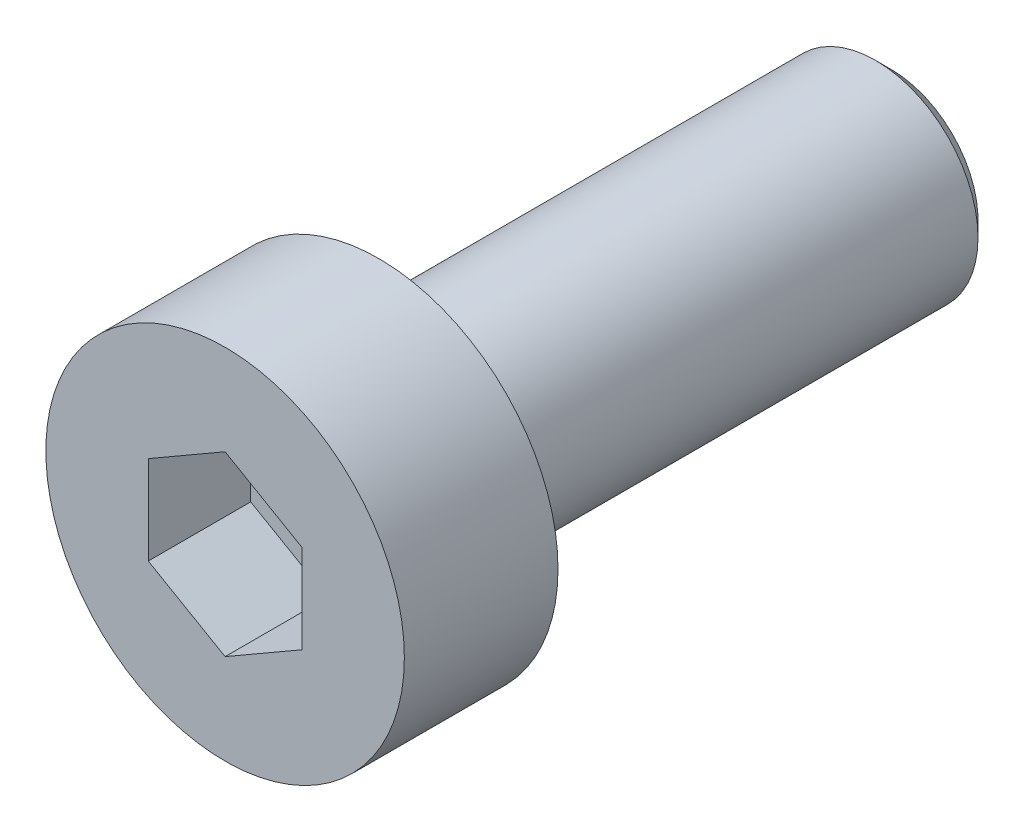
ISO-10303-21;
HEADER;
FILE_DESCRIPTION(('STEP AP214'),'2;1');
FILE_NAME('part.step','',(''),(''),'','','');
FILE_SCHEMA(('AUTOMOTIVE_DESIGN { 1 0 10303 214 1 1 1 1 }'));
ENDSEC;
DATA;
#1=APPLICATION_CONTEXT('core data for automotive mechanical design processes');
#2=APPLICATION_PROTOCOL_DEFINITION('international standard','automotive_design',2000,#1);
#3=PRODUCT_CONTEXT('',#1,'mechanical');
#4=PRODUCT('Part','Part','',(#3));
#5=PRODUCT_RELATED_PRODUCT_CATEGORY('part','',(#4));
#6=PRODUCT_DEFINITION_FORMATION('','',#4);
#7=PRODUCT_DEFINITION_CONTEXT('part definition',#1,'design');
#8=PRODUCT_DEFINITION('design','',#6,#7);
#9=PRODUCT_DEFINITION_SHAPE('','',#8);
#10=(LENGTH_UNIT() NAMED_UNIT(*) SI_UNIT(.MILLI.,.METRE.));
#11=(NAMED_UNIT(*) PLANE_ANGLE_UNIT() SI_UNIT($,.RADIAN.));
#12=(NAMED_UNIT(*) SI_UNIT($,.STERADIAN.) SOLID_ANGLE_UNIT());
#13=UNCERTAINTY_MEASURE_WITH_UNIT(LENGTH_MEASURE(1.E-05),#10,'distance_accuracy_value','');
#14=(GEOMETRIC_REPRESENTATION_CONTEXT(3) GLOBAL_UNCERTAINTY_ASSIGNED_CONTEXT((#13)) GLOBAL_UNIT_ASSIGNED_CONTEXT((#10,
#11,#12)) REPRESENTATION_CONTEXT('',''));
#15=CARTESIAN_POINT('',(0.,0.,0.));
#16=DIRECTION('',(0.,0.,1.));
#17=DIRECTION('',(1.,0.,0.));
#18=AXIS2_PLACEMENT_3D('',#15,#16,#17);
#19=CARTESIAN_POINT('',(0.,0.,0.));
#20=DIRECTION('',(0.,0.,1.));
#21=DIRECTION('',(1.,0.,0.));
#22=AXIS2_PLACEMENT_3D('',#19,#20,#21);
#23=PLANE('',#22);
#24=CARTESIAN_POINT('',(0.,0.,0.));
#25=DIRECTION('',(0.,0.,1.));
#26=DIRECTION('',(1.,0.,0.));
#27=AXIS2_PLACEMENT_3D('',#24,#25,#26);
#28=CIRCLE('',#27,3.5);
#29=CARTESIAN_POINT('',(3.5,0.,0.));
#30=VERTEX_POINT('',#29);
#31=EDGE_CURVE('E135',#30,#30,#28,.T.);
#32=ORIENTED_EDGE('',*,*,#31,.F.);
#33=EDGE_LOOP('',(#32));
#34=FACE_BOUND('',#33,.T.);
#35=CARTESIAN_POINT('',(0.,0.,0.));
#36=DIRECTION('',(0.,0.,1.));
#37=DIRECTION('',(1.,0.,0.));
#38=AXIS2_PLACEMENT_3D('',#35,#36,#37);
#39=CIRCLE('',#38,2.);
#40=CARTESIAN_POINT('',(2.,0.,0.));
#41=VERTEX_POINT('',#40);
#42=EDGE_CURVE('E144',#41,#41,#39,.F.);
#43=ORIENTED_EDGE('',*,*,#42,.F.);
#44=EDGE_LOOP('',(#43));
#45=FACE_BOUND('',#44,.T.);
#46=ADVANCED_FACE('F33',(#34,#45),#23,.F.);
#47=CARTESIAN_POINT('',(0.,0.,3.));
#48=DIRECTION('',(0.,0.,-1.));
#49=DIRECTION('',(-1.,0.,0.));
#50=AXIS2_PLACEMENT_3D('',#47,#48,#49);
#51=CYLINDRICAL_SURFACE('',#50,3.5);
#52=CARTESIAN_POINT('',(0.,0.,3.));
#53=DIRECTION('',(0.,0.,1.));
#54=DIRECTION('',(1.,0.,0.));
#55=AXIS2_PLACEMENT_3D('',#52,#53,#54);
#56=CIRCLE('',#55,3.5);
#57=CARTESIAN_POINT('',(3.5,0.,3.));
#58=VERTEX_POINT('',#57);
#59=EDGE_CURVE('E141',#58,#58,#56,.T.);
#60=ORIENTED_EDGE('',*,*,#59,.F.);
#61=EDGE_LOOP('',(#60));
#62=FACE_BOUND('',#61,.T.);
#63=ORIENTED_EDGE('',*,*,#31,.T.);
#64=EDGE_LOOP('',(#63));
#65=FACE_BOUND('',#64,.T.);
#66=ADVANCED_FACE('F166',(#62,#65),#51,.T.);
#67=CARTESIAN_POINT('',(0.,0.,3.));
#68=DIRECTION('',(0.,0.,1.));
#69=DIRECTION('',(1.,0.,0.));
#70=AXIS2_PLACEMENT_3D('',#67,#68,#69);
#71=PLANE('',#70);
#72=DIRECTION('',(-0.866025403784439,0.5,0.));
#73=VECTOR('',#72,1.);
#74=CARTESIAN_POINT('',(1.5,0.866025403784439,3.));
#75=LINE('',#74,#73);
#76=CARTESIAN_POINT('',(1.5,0.866025403784439,3.));
#77=VERTEX_POINT('',#76);
#78=CARTESIAN_POINT('',(0.,1.73205080756888,3.));
#79=VERTEX_POINT('',#78);
#80=EDGE_CURVE('E48',#77,#79,#75,.T.);
#81=ORIENTED_EDGE('',*,*,#80,.F.);
#82=DIRECTION('',(0.,1.,0.));
#83=VECTOR('',#82,1.);
#84=CARTESIAN_POINT('',(1.5,-0.866025403784439,3.));
#85=LINE('',#84,#83);
#86=CARTESIAN_POINT('',(1.5,-0.866025403784439,3.));
#87=VERTEX_POINT('',#86);
#88=EDGE_CURVE('E131',#87,#77,#85,.T.);
#89=ORIENTED_EDGE('',*,*,#88,.F.);
#90=DIRECTION('',(0.866025403784439,0.5,0.));
#91=VECTOR('',#90,1.);
#92=CARTESIAN_POINT('',(0.,-1.73205080756888,3.));
#93=LINE('',#92,#91);
#94=CARTESIAN_POINT('',(0.,-1.73205080756888,3.));
#95=VERTEX_POINT('',#94);
#96=EDGE_CURVE('E129',#95,#87,#93,.T.);
#97=ORIENTED_EDGE('',*,*,#96,.F.);
#98=DIRECTION('',(0.866025403784439,-0.5,0.));
#99=VECTOR('',#98,1.);
#100=CARTESIAN_POINT('',(-1.5,-0.866025403784439,3.));
#101=LINE('',#100,#99);
#102=CARTESIAN_POINT('',(-1.5,-0.866025403784439,3.));
#103=VERTEX_POINT('',#102);
#104=EDGE_CURVE('E96',#103,#95,#101,.T.);
#105=ORIENTED_EDGE('',*,*,#104,.F.);
#106=DIRECTION('',(0.,-1.,0.));
#107=VECTOR('',#106,1.);
#108=CARTESIAN_POINT('',(-1.5,0.866025403784439,3.));
#109=LINE('',#108,#107);
#110=CARTESIAN_POINT('',(-1.5,0.866025403784439,3.));
#111=VERTEX_POINT('',#110);
#112=EDGE_CURVE('E125',#111,#103,#109,.T.);
#113=ORIENTED_EDGE('',*,*,#112,.F.);
#114=DIRECTION('',(-0.866025403784439,-0.5,0.));
#115=VECTOR('',#114,1.);
#116=CARTESIAN_POINT('',(0.,1.73205080756888,3.));
#117=LINE('',#116,#115);
#118=EDGE_CURVE('E122',#79,#111,#117,.T.);
#119=ORIENTED_EDGE('',*,*,#118,.F.);
#120=EDGE_LOOP('',(#81,#89,#97,#105,#113,#119));
#121=FACE_BOUND('',#120,.T.);
#122=ORIENTED_EDGE('',*,*,#59,.T.);
#123=EDGE_LOOP('',(#122));
#124=FACE_BOUND('',#123,.T.);
#125=ADVANCED_FACE('F172',(#121,#124),#71,.T.);
#126=CARTESIAN_POINT('',(0.,0.,-10.));
#127=DIRECTION('',(0.,0.,1.));
#128=DIRECTION('',(1.,0.,0.));
#129=AXIS2_PLACEMENT_3D('',#126,#127,#128);
#130=CYLINDRICAL_SURFACE('',#129,2.);
#131=CARTESIAN_POINT('',(0.,0.,-9.7));
#132=DIRECTION('',(0.,0.,-1.));
#133=DIRECTION('',(-1.,0.,0.));
#134=AXIS2_PLACEMENT_3D('',#131,#132,#133);
#135=CIRCLE('',#134,2.);
#136=CARTESIAN_POINT('',(-2.,0.,-9.7));
#137=VERTEX_POINT('',#136);
#138=EDGE_CURVE('E11',#137,#137,#135,.F.);
#139=ORIENTED_EDGE('',*,*,#138,.T.);
#140=EDGE_LOOP('',(#139));
#141=FACE_BOUND('',#140,.T.);
#142=ORIENTED_EDGE('',*,*,#42,.T.);
#143=EDGE_LOOP('',(#142));
#144=FACE_BOUND('',#143,.T.);
#145=ADVANCED_FACE('F162',(#141,#144),#130,.T.);
#146=CARTESIAN_POINT('',(0.,0.,-10.));
#147=DIRECTION('',(0.,0.,-1.));
#148=DIRECTION('',(-1.,0.,0.));
#149=AXIS2_PLACEMENT_3D('',#146,#147,#148);
#150=PLANE('',#149);
#151=CARTESIAN_POINT('',(0.,0.,-10.));
#152=DIRECTION('',(0.,0.,-1.));
#153=DIRECTION('',(-1.,0.,0.));
#154=AXIS2_PLACEMENT_3D('',#151,#152,#153);
#155=CIRCLE('',#154,1.7);
#156=CARTESIAN_POINT('',(-1.7,0.,-10.));
#157=VERTEX_POINT('',#156);
#158=EDGE_CURVE('E41',#157,#157,#155,.T.);
#159=ORIENTED_EDGE('',*,*,#158,.T.);
#160=EDGE_LOOP('',(#159));
#161=FACE_BOUND('',#160,.T.);
#162=ADVANCED_FACE('F151',(#161),#150,.T.);
#163=CARTESIAN_POINT('',(0.,0.,-10.));
#164=DIRECTION('',(0.,0.,1.));
#165=DIRECTION('',(1.,0.,0.));
#166=AXIS2_PLACEMENT_3D('',#163,#164,#165);
#167=CONICAL_SURFACE('',#166,1.7,0.785398163397446);
#168=ORIENTED_EDGE('',*,*,#138,.F.);
#169=EDGE_LOOP('',(#168));
#170=FACE_BOUND('',#169,.T.);
#171=ORIENTED_EDGE('',*,*,#158,.F.);
#172=EDGE_LOOP('',(#171));
#173=FACE_BOUND('',#172,.T.);
#174=ADVANCED_FACE('F35',(#170,#173),#167,.T.);
#175=CARTESIAN_POINT('',(1.5,0.866025403784439,1.));
#176=DIRECTION('',(0.5,0.866025403784439,0.));
#177=DIRECTION('',(-0.866025403784439,0.5,0.));
#178=AXIS2_PLACEMENT_3D('',#175,#176,#177);
#179=PLANE('',#178);
#180=ORIENTED_EDGE('',*,*,#80,.T.);
#181=DIRECTION('',(0.,0.,1.));
#182=VECTOR('',#181,1.);
#183=CARTESIAN_POINT('',(0.,1.73205080756888,1.));
#184=LINE('',#183,#182);
#185=CARTESIAN_POINT('',(0.,1.73205080756888,1.));
#186=VERTEX_POINT('',#185);
#187=EDGE_CURVE('E78',#186,#79,#184,.T.);
#188=ORIENTED_EDGE('',*,*,#187,.F.);
#189=DIRECTION('',(-0.866025403784439,0.5,0.));
#190=VECTOR('',#189,1.);
#191=CARTESIAN_POINT('',(1.5,0.866025403784439,1.));
#192=LINE('',#191,#190);
#193=CARTESIAN_POINT('',(1.5,0.866025403784439,1.));
#194=VERTEX_POINT('',#193);
#195=EDGE_CURVE('E133',#194,#186,#192,.T.);
#196=ORIENTED_EDGE('',*,*,#195,.F.);
#197=DIRECTION('',(0.,0.,1.));
#198=VECTOR('',#197,1.);
#199=CARTESIAN_POINT('',(1.5,0.866025403784439,1.));
#200=LINE('',#199,#198);
#201=EDGE_CURVE('E56',#194,#77,#200,.T.);
#202=ORIENTED_EDGE('',*,*,#201,.T.);
#203=EDGE_LOOP('',(#180,#188,#196,#202));
#204=FACE_BOUND('',#203,.T.);
#205=ADVANCED_FACE('F154',(#204),#179,.F.);
#206=CARTESIAN_POINT('',(1.5,-0.866025403784439,1.));
#207=DIRECTION('',(1.,0.,0.));
#208=DIRECTION('',(0.,1.,0.));
#209=AXIS2_PLACEMENT_3D('',#206,#207,#208);
#210=PLANE('',#209);
#211=ORIENTED_EDGE('',*,*,#88,.T.);
#212=ORIENTED_EDGE('',*,*,#201,.F.);
#213=DIRECTION('',(0.,1.,0.));
#214=VECTOR('',#213,1.);
#215=CARTESIAN_POINT('',(1.5,-0.866025403784439,1.));
#216=LINE('',#215,#214);
#217=CARTESIAN_POINT('',(1.5,-0.866025403784439,1.));
#218=VERTEX_POINT('',#217);
#219=EDGE_CURVE('E108',#218,#194,#216,.T.);
#220=ORIENTED_EDGE('',*,*,#219,.F.);
#221=DIRECTION('',(0.,0.,1.));
#222=VECTOR('',#221,1.);
#223=CARTESIAN_POINT('',(1.5,-0.866025403784439,1.));
#224=LINE('',#223,#222);
#225=EDGE_CURVE('E100',#218,#87,#224,.T.);
#226=ORIENTED_EDGE('',*,*,#225,.T.);
#227=EDGE_LOOP('',(#211,#212,#220,#226));
#228=FACE_BOUND('',#227,.T.);
#229=ADVANCED_FACE('F160',(#228),#210,.F.);
#230=CARTESIAN_POINT('',(0.,-1.73205080756888,1.));
#231=DIRECTION('',(0.5,-0.866025403784439,0.));
#232=DIRECTION('',(0.866025403784439,0.5,0.));
#233=AXIS2_PLACEMENT_3D('',#230,#231,#232);
#234=PLANE('',#233);
#235=ORIENTED_EDGE('',*,*,#96,.T.);
#236=ORIENTED_EDGE('',*,*,#225,.F.);
#237=DIRECTION('',(0.866025403784439,0.5,0.));
#238=VECTOR('',#237,1.);
#239=CARTESIAN_POINT('',(0.,-1.73205080756888,1.));
#240=LINE('',#239,#238);
#241=CARTESIAN_POINT('',(0.,-1.73205080756888,1.));
#242=VERTEX_POINT('',#241);
#243=EDGE_CURVE('E104',#242,#218,#240,.T.);
#244=ORIENTED_EDGE('',*,*,#243,.F.);
#245=DIRECTION('',(0.,0.,1.));
#246=VECTOR('',#245,1.);
#247=CARTESIAN_POINT('',(0.,-1.73205080756888,1.));
#248=LINE('',#247,#246);
#249=EDGE_CURVE('E89',#242,#95,#248,.T.);
#250=ORIENTED_EDGE('',*,*,#249,.T.);
#251=EDGE_LOOP('',(#235,#236,#244,#250));
#252=FACE_BOUND('',#251,.T.);
#253=ADVANCED_FACE('F105',(#252),#234,.F.);
#254=CARTESIAN_POINT('',(-1.5,-0.866025403784439,1.));
#255=DIRECTION('',(-0.5,-0.866025403784439,0.));
#256=DIRECTION('',(0.866025403784439,-0.5,0.));
#257=AXIS2_PLACEMENT_3D('',#254,#255,#256);
#258=PLANE('',#257);
#259=ORIENTED_EDGE('',*,*,#104,.T.);
#260=ORIENTED_EDGE('',*,*,#249,.F.);
#261=DIRECTION('',(0.866025403784439,-0.5,0.));
#262=VECTOR('',#261,1.);
#263=CARTESIAN_POINT('',(-1.5,-0.866025403784439,1.));
#264=LINE('',#263,#262);
#265=CARTESIAN_POINT('',(-1.5,-0.866025403784439,1.));
#266=VERTEX_POINT('',#265);
#267=EDGE_CURVE('E93',#266,#242,#264,.T.);
#268=ORIENTED_EDGE('',*,*,#267,.F.);
#269=DIRECTION('',(0.,0.,1.));
#270=VECTOR('',#269,1.);
#271=CARTESIAN_POINT('',(-1.5,-0.866025403784439,1.));
#272=LINE('',#271,#270);
#273=EDGE_CURVE('E101',#266,#103,#272,.T.);
#274=ORIENTED_EDGE('',*,*,#273,.T.);
#275=EDGE_LOOP('',(#259,#260,#268,#274));
#276=FACE_BOUND('',#275,.T.);
#277=ADVANCED_FACE('F91',(#276),#258,.F.);
#278=CARTESIAN_POINT('',(-1.5,0.866025403784439,1.));
#279=DIRECTION('',(-1.,0.,0.));
#280=DIRECTION('',(0.,0.,1.));
#281=AXIS2_PLACEMENT_3D('',#278,#279,#280);
#282=PLANE('',#281);
#283=ORIENTED_EDGE('',*,*,#112,.T.);
#284=ORIENTED_EDGE('',*,*,#273,.F.);
#285=DIRECTION('',(0.,-1.,0.));
#286=VECTOR('',#285,1.);
#287=CARTESIAN_POINT('',(-1.5,0.866025403784439,1.));
#288=LINE('',#287,#286);
#289=CARTESIAN_POINT('',(-1.5,0.866025403784439,1.));
#290=VERTEX_POINT('',#289);
#291=EDGE_CURVE('E114',#290,#266,#288,.T.);
#292=ORIENTED_EDGE('',*,*,#291,.F.);
#293=DIRECTION('',(0.,0.,1.));
#294=VECTOR('',#293,1.);
#295=CARTESIAN_POINT('',(-1.5,0.866025403784439,1.));
#296=LINE('',#295,#294);
#297=EDGE_CURVE('E138',#290,#111,#296,.T.);
#298=ORIENTED_EDGE('',*,*,#297,.T.);
#299=EDGE_LOOP('',(#283,#284,#292,#298));
#300=FACE_BOUND('',#299,.T.);
#301=ADVANCED_FACE('F186',(#300),#282,.F.);
#302=CARTESIAN_POINT('',(0.,1.73205080756888,1.));
#303=DIRECTION('',(-0.5,0.866025403784439,0.));
#304=DIRECTION('',(-0.866025403784439,-0.5,0.));
#305=AXIS2_PLACEMENT_3D('',#302,#303,#304);
#306=PLANE('',#305);
#307=ORIENTED_EDGE('',*,*,#118,.T.);
#308=ORIENTED_EDGE('',*,*,#297,.F.);
#309=DIRECTION('',(-0.866025403784439,-0.5,0.));
#310=VECTOR('',#309,1.);
#311=CARTESIAN_POINT('',(0.,1.73205080756888,1.));
#312=LINE('',#311,#310);
#313=EDGE_CURVE('E116',#186,#290,#312,.T.);
#314=ORIENTED_EDGE('',*,*,#313,.F.);
#315=ORIENTED_EDGE('',*,*,#187,.T.);
#316=EDGE_LOOP('',(#307,#308,#314,#315));
#317=FACE_BOUND('',#316,.T.);
#318=ADVANCED_FACE('F183',(#317),#306,.F.);
#319=CARTESIAN_POINT('',(0.,0.,1.));
#320=DIRECTION('',(0.,0.,1.));
#321=DIRECTION('',(1.,0.,0.));
#322=AXIS2_PLACEMENT_3D('',#319,#320,#321);
#323=PLANE('',#322);
#324=ORIENTED_EDGE('',*,*,#195,.T.);
#325=ORIENTED_EDGE('',*,*,#313,.T.);
#326=ORIENTED_EDGE('',*,*,#291,.T.);
#327=ORIENTED_EDGE('',*,*,#267,.T.);
#328=ORIENTED_EDGE('',*,*,#243,.T.);
#329=ORIENTED_EDGE('',*,*,#219,.T.);
#330=EDGE_LOOP('',(#324,#325,#326,#327,#328,#329));
#331=FACE_BOUND('',#330,.T.);
#332=ADVANCED_FACE('F111',(#331),#323,.T.);
#333=CLOSED_SHELL('',(#46,#66,#125,#145,#162,#174,#205,#229,#253,#277,#301,#318,#332));
#334=MANIFOLD_SOLID_BREP('B2',#333);
#335=ADVANCED_BREP_SHAPE_REPRESENTATION('',(#18,#334),#14);
#336=SHAPE_DEFINITION_REPRESENTATION(#9,#335);
ENDSEC;
END-ISO-10303-21;
